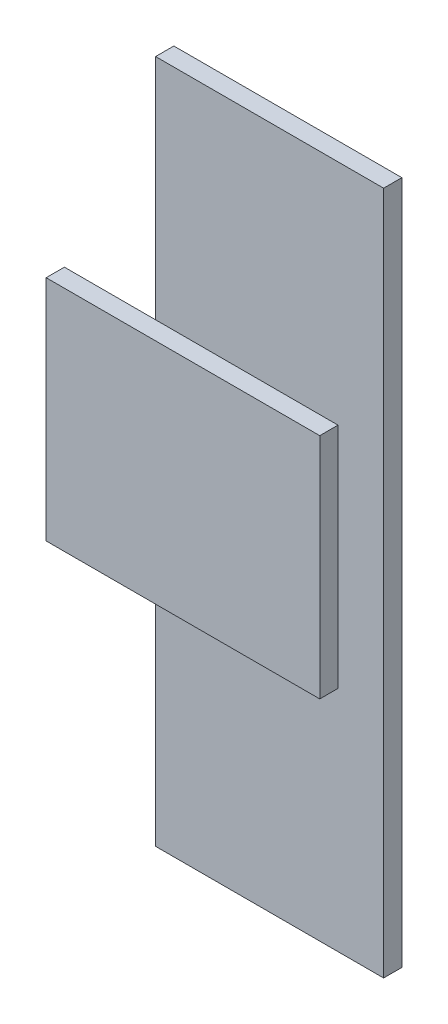
ISO-10303-21;
HEADER;
FILE_DESCRIPTION(('STEP AP214'),'2;1');
FILE_NAME('part.step','',(''),(''),'','','');
FILE_SCHEMA(('AUTOMOTIVE_DESIGN { 1 0 10303 214 1 1 1 1 }'));
ENDSEC;
DATA;
#1=APPLICATION_CONTEXT('core data for automotive mechanical design processes');
#2=APPLICATION_PROTOCOL_DEFINITION('international standard','automotive_design',2000,#1);
#3=PRODUCT_CONTEXT('',#1,'mechanical');
#4=PRODUCT('Part','Part','',(#3));
#5=PRODUCT_RELATED_PRODUCT_CATEGORY('part','',(#4));
#6=PRODUCT_DEFINITION_FORMATION('','',#4);
#7=PRODUCT_DEFINITION_CONTEXT('part definition',#1,'design');
#8=PRODUCT_DEFINITION('design','',#6,#7);
#9=PRODUCT_DEFINITION_SHAPE('','',#8);
#10=(LENGTH_UNIT() NAMED_UNIT(*) SI_UNIT(.MILLI.,.METRE.));
#11=(NAMED_UNIT(*) PLANE_ANGLE_UNIT() SI_UNIT($,.RADIAN.));
#12=(NAMED_UNIT(*) SI_UNIT($,.STERADIAN.) SOLID_ANGLE_UNIT());
#13=UNCERTAINTY_MEASURE_WITH_UNIT(LENGTH_MEASURE(1.E-05),#10,'distance_accuracy_value','');
#14=(GEOMETRIC_REPRESENTATION_CONTEXT(3) GLOBAL_UNCERTAINTY_ASSIGNED_CONTEXT((#13)) GLOBAL_UNIT_ASSIGNED_CONTEXT((#10,
#11,#12)) REPRESENTATION_CONTEXT('',''));
#15=CARTESIAN_POINT('',(0.,0.,0.));
#16=DIRECTION('',(0.,0.,1.));
#17=DIRECTION('',(1.,0.,0.));
#18=AXIS2_PLACEMENT_3D('',#15,#16,#17);
#19=CARTESIAN_POINT('',(0.,0.,4.));
#20=DIRECTION('',(0.,0.,-1.));
#21=DIRECTION('',(-1.,0.,0.));
#22=AXIS2_PLACEMENT_3D('',#19,#20,#21);
#23=PLANE('',#22);
#24=DIRECTION('',(-1.,0.,0.));
#25=VECTOR('',#24,1.);
#26=CARTESIAN_POINT('',(-20.,100.,4.));
#27=LINE('',#26,#25);
#28=CARTESIAN_POINT('',(40.,100.,4.));
#29=VERTEX_POINT('',#28);
#30=CARTESIAN_POINT('',(0.,100.,4.));
#31=VERTEX_POINT('',#30);
#32=EDGE_CURVE('E53',#29,#31,#27,.T.);
#33=ORIENTED_EDGE('',*,*,#32,.F.);
#34=DIRECTION('',(0.,1.,0.));
#35=VECTOR('',#34,1.);
#36=CARTESIAN_POINT('',(40.,100.,4.));
#37=LINE('',#36,#35);
#38=CARTESIAN_POINT('',(40.,50.,4.));
#39=VERTEX_POINT('',#38);
#40=EDGE_CURVE('E189',#39,#29,#37,.T.);
#41=ORIENTED_EDGE('',*,*,#40,.F.);
#42=DIRECTION('',(1.,0.,0.));
#43=VECTOR('',#42,1.);
#44=CARTESIAN_POINT('',(-20.,50.,4.));
#45=LINE('',#44,#43);
#46=CARTESIAN_POINT('',(0.,50.,4.));
#47=VERTEX_POINT('',#46);
#48=EDGE_CURVE('E11',#47,#39,#45,.T.);
#49=ORIENTED_EDGE('',*,*,#48,.F.);
#50=DIRECTION('',(0.,-1.,0.));
#51=VECTOR('',#50,1.);
#52=CARTESIAN_POINT('',(0.,0.,4.));
#53=LINE('',#52,#51);
#54=CARTESIAN_POINT('',(0.,0.,4.));
#55=VERTEX_POINT('',#54);
#56=EDGE_CURVE('E145',#47,#55,#53,.T.);
#57=ORIENTED_EDGE('',*,*,#56,.T.);
#58=DIRECTION('',(1.,0.,0.));
#59=VECTOR('',#58,1.);
#60=CARTESIAN_POINT('',(0.,0.,4.));
#61=LINE('',#60,#59);
#62=CARTESIAN_POINT('',(50.,0.,4.));
#63=VERTEX_POINT('',#62);
#64=EDGE_CURVE('E143',#55,#63,#61,.T.);
#65=ORIENTED_EDGE('',*,*,#64,.T.);
#66=DIRECTION('',(0.,1.,0.));
#67=VECTOR('',#66,1.);
#68=CARTESIAN_POINT('',(50.,0.,4.));
#69=LINE('',#68,#67);
#70=CARTESIAN_POINT('',(50.,150.,4.));
#71=VERTEX_POINT('',#70);
#72=EDGE_CURVE('E147',#63,#71,#69,.T.);
#73=ORIENTED_EDGE('',*,*,#72,.T.);
#74=DIRECTION('',(-1.,0.,0.));
#75=VECTOR('',#74,1.);
#76=CARTESIAN_POINT('',(0.,150.,4.));
#77=LINE('',#76,#75);
#78=CARTESIAN_POINT('',(0.,150.,4.));
#79=VERTEX_POINT('',#78);
#80=EDGE_CURVE('E149',#71,#79,#77,.T.);
#81=ORIENTED_EDGE('',*,*,#80,.T.);
#82=EDGE_CURVE('E141',#79,#31,#53,.T.);
#83=ORIENTED_EDGE('',*,*,#82,.T.);
#84=EDGE_LOOP('',(#33,#41,#49,#57,#65,#73,#81,#83));
#85=FACE_BOUND('',#84,.T.);
#86=ADVANCED_FACE('F36',(#85),#23,.F.);
#87=CARTESIAN_POINT('',(0.,0.,4.));
#88=DIRECTION('',(1.,0.,0.));
#89=DIRECTION('',(0.,0.,-1.));
#90=AXIS2_PLACEMENT_3D('',#87,#88,#89);
#91=PLANE('',#90);
#92=DIRECTION('',(0.,-1.,0.));
#93=VECTOR('',#92,1.);
#94=CARTESIAN_POINT('',(0.,0.,0.));
#95=LINE('',#94,#93);
#96=CARTESIAN_POINT('',(0.,150.,0.));
#97=VERTEX_POINT('',#96);
#98=CARTESIAN_POINT('',(0.,0.,0.));
#99=VERTEX_POINT('',#98);
#100=EDGE_CURVE('E132',#97,#99,#95,.T.);
#101=ORIENTED_EDGE('',*,*,#100,.T.);
#102=DIRECTION('',(0.,0.,-1.));
#103=VECTOR('',#102,1.);
#104=CARTESIAN_POINT('',(0.,0.,4.));
#105=LINE('',#104,#103);
#106=EDGE_CURVE('E40',#55,#99,#105,.T.);
#107=ORIENTED_EDGE('',*,*,#106,.F.);
#108=ORIENTED_EDGE('',*,*,#56,.F.);
#109=EDGE_CURVE('E144',#31,#47,#53,.T.);
#110=ORIENTED_EDGE('',*,*,#109,.F.);
#111=ORIENTED_EDGE('',*,*,#82,.F.);
#112=DIRECTION('',(0.,0.,-1.));
#113=VECTOR('',#112,1.);
#114=CARTESIAN_POINT('',(0.,150.,4.));
#115=LINE('',#114,#113);
#116=EDGE_CURVE('E150',#79,#97,#115,.T.);
#117=ORIENTED_EDGE('',*,*,#116,.T.);
#118=EDGE_LOOP('',(#101,#107,#108,#110,#111,#117));
#119=FACE_BOUND('',#118,.T.);
#120=ADVANCED_FACE('F38',(#119),#91,.F.);
#121=CARTESIAN_POINT('',(0.,0.,4.));
#122=DIRECTION('',(0.,1.,0.));
#123=DIRECTION('',(0.,0.,1.));
#124=AXIS2_PLACEMENT_3D('',#121,#122,#123);
#125=PLANE('',#124);
#126=DIRECTION('',(1.,0.,0.));
#127=VECTOR('',#126,1.);
#128=CARTESIAN_POINT('',(0.,0.,0.));
#129=LINE('',#128,#127);
#130=CARTESIAN_POINT('',(50.,0.,0.));
#131=VERTEX_POINT('',#130);
#132=EDGE_CURVE('E135',#99,#131,#129,.T.);
#133=ORIENTED_EDGE('',*,*,#132,.T.);
#134=DIRECTION('',(0.,0.,-1.));
#135=VECTOR('',#134,1.);
#136=CARTESIAN_POINT('',(50.,0.,4.));
#137=LINE('',#136,#135);
#138=EDGE_CURVE('E161',#63,#131,#137,.T.);
#139=ORIENTED_EDGE('',*,*,#138,.F.);
#140=ORIENTED_EDGE('',*,*,#64,.F.);
#141=ORIENTED_EDGE('',*,*,#106,.T.);
#142=EDGE_LOOP('',(#133,#139,#140,#141));
#143=FACE_BOUND('',#142,.T.);
#144=ADVANCED_FACE('F171',(#143),#125,.F.);
#145=CARTESIAN_POINT('',(50.,0.,4.));
#146=DIRECTION('',(-1.,0.,0.));
#147=DIRECTION('',(0.,0.,1.));
#148=AXIS2_PLACEMENT_3D('',#145,#146,#147);
#149=PLANE('',#148);
#150=DIRECTION('',(0.,1.,0.));
#151=VECTOR('',#150,1.);
#152=CARTESIAN_POINT('',(50.,0.,0.));
#153=LINE('',#152,#151);
#154=CARTESIAN_POINT('',(50.,150.,0.));
#155=VERTEX_POINT('',#154);
#156=EDGE_CURVE('E153',#131,#155,#153,.T.);
#157=ORIENTED_EDGE('',*,*,#156,.T.);
#158=DIRECTION('',(0.,0.,-1.));
#159=VECTOR('',#158,1.);
#160=CARTESIAN_POINT('',(50.,150.,4.));
#161=LINE('',#160,#159);
#162=EDGE_CURVE('E159',#71,#155,#161,.T.);
#163=ORIENTED_EDGE('',*,*,#162,.F.);
#164=ORIENTED_EDGE('',*,*,#72,.F.);
#165=ORIENTED_EDGE('',*,*,#138,.T.);
#166=EDGE_LOOP('',(#157,#163,#164,#165));
#167=FACE_BOUND('',#166,.T.);
#168=ADVANCED_FACE('F180',(#167),#149,.F.);
#169=CARTESIAN_POINT('',(0.,150.,4.));
#170=DIRECTION('',(0.,-1.,0.));
#171=DIRECTION('',(0.,0.,-1.));
#172=AXIS2_PLACEMENT_3D('',#169,#170,#171);
#173=PLANE('',#172);
#174=DIRECTION('',(-1.,0.,0.));
#175=VECTOR('',#174,1.);
#176=CARTESIAN_POINT('',(0.,150.,0.));
#177=LINE('',#176,#175);
#178=EDGE_CURVE('E155',#155,#97,#177,.T.);
#179=ORIENTED_EDGE('',*,*,#178,.T.);
#180=ORIENTED_EDGE('',*,*,#116,.F.);
#181=ORIENTED_EDGE('',*,*,#80,.F.);
#182=ORIENTED_EDGE('',*,*,#162,.T.);
#183=EDGE_LOOP('',(#179,#180,#181,#182));
#184=FACE_BOUND('',#183,.T.);
#185=ADVANCED_FACE('F183',(#184),#173,.F.);
#186=CARTESIAN_POINT('',(0.,0.,0.));
#187=DIRECTION('',(0.,0.,-1.));
#188=DIRECTION('',(-1.,0.,0.));
#189=AXIS2_PLACEMENT_3D('',#186,#187,#188);
#190=PLANE('',#189);
#191=ORIENTED_EDGE('',*,*,#100,.F.);
#192=ORIENTED_EDGE('',*,*,#178,.F.);
#193=ORIENTED_EDGE('',*,*,#156,.F.);
#194=ORIENTED_EDGE('',*,*,#132,.F.);
#195=EDGE_LOOP('',(#191,#192,#193,#194));
#196=FACE_BOUND('',#195,.T.);
#197=ADVANCED_FACE('F178',(#196),#190,.T.);
#198=CARTESIAN_POINT('',(0.,0.,4.));
#199=DIRECTION('',(0.,0.,1.));
#200=DIRECTION('',(1.,0.,0.));
#201=AXIS2_PLACEMENT_3D('',#198,#199,#200);
#202=PLANE('',#201);
#203=CARTESIAN_POINT('',(-20.,100.,4.));
#204=VERTEX_POINT('',#203);
#205=EDGE_CURVE('E188',#31,#204,#27,.T.);
#206=ORIENTED_EDGE('',*,*,#205,.F.);
#207=ORIENTED_EDGE('',*,*,#109,.T.);
#208=CARTESIAN_POINT('',(-20.,50.,4.));
#209=VERTEX_POINT('',#208);
#210=EDGE_CURVE('E46',#209,#47,#45,.T.);
#211=ORIENTED_EDGE('',*,*,#210,.F.);
#212=DIRECTION('',(0.,-1.,0.));
#213=VECTOR('',#212,1.);
#214=CARTESIAN_POINT('',(-20.,100.,4.));
#215=LINE('',#214,#213);
#216=EDGE_CURVE('E131',#204,#209,#215,.T.);
#217=ORIENTED_EDGE('',*,*,#216,.F.);
#218=EDGE_LOOP('',(#206,#207,#211,#217));
#219=FACE_BOUND('',#218,.T.);
#220=ADVANCED_FACE('F187',(#219),#202,.F.);
#221=CARTESIAN_POINT('',(-20.,100.,8.));
#222=DIRECTION('',(1.,0.,0.));
#223=DIRECTION('',(0.,0.,-1.));
#224=AXIS2_PLACEMENT_3D('',#221,#222,#223);
#225=PLANE('',#224);
#226=ORIENTED_EDGE('',*,*,#216,.T.);
#227=DIRECTION('',(0.,0.,-1.));
#228=VECTOR('',#227,1.);
#229=CARTESIAN_POINT('',(-20.,50.,8.));
#230=LINE('',#229,#228);
#231=CARTESIAN_POINT('',(-20.,50.,8.));
#232=VERTEX_POINT('',#231);
#233=EDGE_CURVE('E112',#232,#209,#230,.T.);
#234=ORIENTED_EDGE('',*,*,#233,.F.);
#235=DIRECTION('',(0.,-1.,0.));
#236=VECTOR('',#235,1.);
#237=CARTESIAN_POINT('',(-20.,100.,8.));
#238=LINE('',#237,#236);
#239=CARTESIAN_POINT('',(-20.,100.,8.));
#240=VERTEX_POINT('',#239);
#241=EDGE_CURVE('E119',#240,#232,#238,.T.);
#242=ORIENTED_EDGE('',*,*,#241,.F.);
#243=DIRECTION('',(0.,0.,-1.));
#244=VECTOR('',#243,1.);
#245=CARTESIAN_POINT('',(-20.,100.,8.));
#246=LINE('',#245,#244);
#247=EDGE_CURVE('E195',#240,#204,#246,.T.);
#248=ORIENTED_EDGE('',*,*,#247,.T.);
#249=EDGE_LOOP('',(#226,#234,#242,#248));
#250=FACE_BOUND('',#249,.T.);
#251=ADVANCED_FACE('F129',(#250),#225,.F.);
#252=CARTESIAN_POINT('',(-20.,50.,8.));
#253=DIRECTION('',(0.,1.,0.));
#254=DIRECTION('',(0.,0.,1.));
#255=AXIS2_PLACEMENT_3D('',#252,#253,#254);
#256=PLANE('',#255);
#257=ORIENTED_EDGE('',*,*,#210,.T.);
#258=ORIENTED_EDGE('',*,*,#48,.T.);
#259=DIRECTION('',(0.,0.,-1.));
#260=VECTOR('',#259,1.);
#261=CARTESIAN_POINT('',(40.,50.,8.));
#262=LINE('',#261,#260);
#263=CARTESIAN_POINT('',(40.,50.,8.));
#264=VERTEX_POINT('',#263);
#265=EDGE_CURVE('E115',#264,#39,#262,.T.);
#266=ORIENTED_EDGE('',*,*,#265,.F.);
#267=DIRECTION('',(1.,0.,0.));
#268=VECTOR('',#267,1.);
#269=CARTESIAN_POINT('',(-20.,50.,8.));
#270=LINE('',#269,#268);
#271=EDGE_CURVE('E107',#232,#264,#270,.T.);
#272=ORIENTED_EDGE('',*,*,#271,.F.);
#273=ORIENTED_EDGE('',*,*,#233,.T.);
#274=EDGE_LOOP('',(#257,#258,#266,#272,#273));
#275=FACE_BOUND('',#274,.T.);
#276=ADVANCED_FACE('F110',(#275),#256,.F.);
#277=CARTESIAN_POINT('',(40.,100.,8.));
#278=DIRECTION('',(-1.,0.,0.));
#279=DIRECTION('',(0.,0.,1.));
#280=AXIS2_PLACEMENT_3D('',#277,#278,#279);
#281=PLANE('',#280);
#282=ORIENTED_EDGE('',*,*,#40,.T.);
#283=DIRECTION('',(0.,0.,-1.));
#284=VECTOR('',#283,1.);
#285=CARTESIAN_POINT('',(40.,100.,8.));
#286=LINE('',#285,#284);
#287=CARTESIAN_POINT('',(40.,100.,8.));
#288=VERTEX_POINT('',#287);
#289=EDGE_CURVE('E137',#288,#29,#286,.T.);
#290=ORIENTED_EDGE('',*,*,#289,.F.);
#291=DIRECTION('',(0.,1.,0.));
#292=VECTOR('',#291,1.);
#293=CARTESIAN_POINT('',(40.,100.,8.));
#294=LINE('',#293,#292);
#295=EDGE_CURVE('E118',#264,#288,#294,.T.);
#296=ORIENTED_EDGE('',*,*,#295,.F.);
#297=ORIENTED_EDGE('',*,*,#265,.T.);
#298=EDGE_LOOP('',(#282,#290,#296,#297));
#299=FACE_BOUND('',#298,.T.);
#300=ADVANCED_FACE('F201',(#299),#281,.F.);
#301=CARTESIAN_POINT('',(-20.,100.,8.));
#302=DIRECTION('',(0.,-1.,0.));
#303=DIRECTION('',(0.,0.,-1.));
#304=AXIS2_PLACEMENT_3D('',#301,#302,#303);
#305=PLANE('',#304);
#306=ORIENTED_EDGE('',*,*,#32,.T.);
#307=ORIENTED_EDGE('',*,*,#205,.T.);
#308=ORIENTED_EDGE('',*,*,#247,.F.);
#309=DIRECTION('',(-1.,0.,0.));
#310=VECTOR('',#309,1.);
#311=CARTESIAN_POINT('',(-20.,100.,8.));
#312=LINE('',#311,#310);
#313=EDGE_CURVE('E124',#288,#240,#312,.T.);
#314=ORIENTED_EDGE('',*,*,#313,.F.);
#315=ORIENTED_EDGE('',*,*,#289,.T.);
#316=EDGE_LOOP('',(#306,#307,#308,#314,#315));
#317=FACE_BOUND('',#316,.T.);
#318=ADVANCED_FACE('F199',(#317),#305,.F.);
#319=CARTESIAN_POINT('',(0.,0.,8.));
#320=DIRECTION('',(0.,0.,1.));
#321=DIRECTION('',(1.,0.,0.));
#322=AXIS2_PLACEMENT_3D('',#319,#320,#321);
#323=PLANE('',#322);
#324=ORIENTED_EDGE('',*,*,#241,.T.);
#325=ORIENTED_EDGE('',*,*,#271,.T.);
#326=ORIENTED_EDGE('',*,*,#295,.T.);
#327=ORIENTED_EDGE('',*,*,#313,.T.);
#328=EDGE_LOOP('',(#324,#325,#326,#327));
#329=FACE_BOUND('',#328,.T.);
#330=ADVANCED_FACE('F122',(#329),#323,.T.);
#331=CLOSED_SHELL('',(#86,#120,#144,#168,#185,#197,#220,#251,#276,#300,#318,#330));
#332=MANIFOLD_SOLID_BREP('B2',#331);
#333=ADVANCED_BREP_SHAPE_REPRESENTATION('',(#18,#332),#14);
#334=SHAPE_DEFINITION_REPRESENTATION(#9,#333);
ENDSEC;
END-ISO-10303-21;
